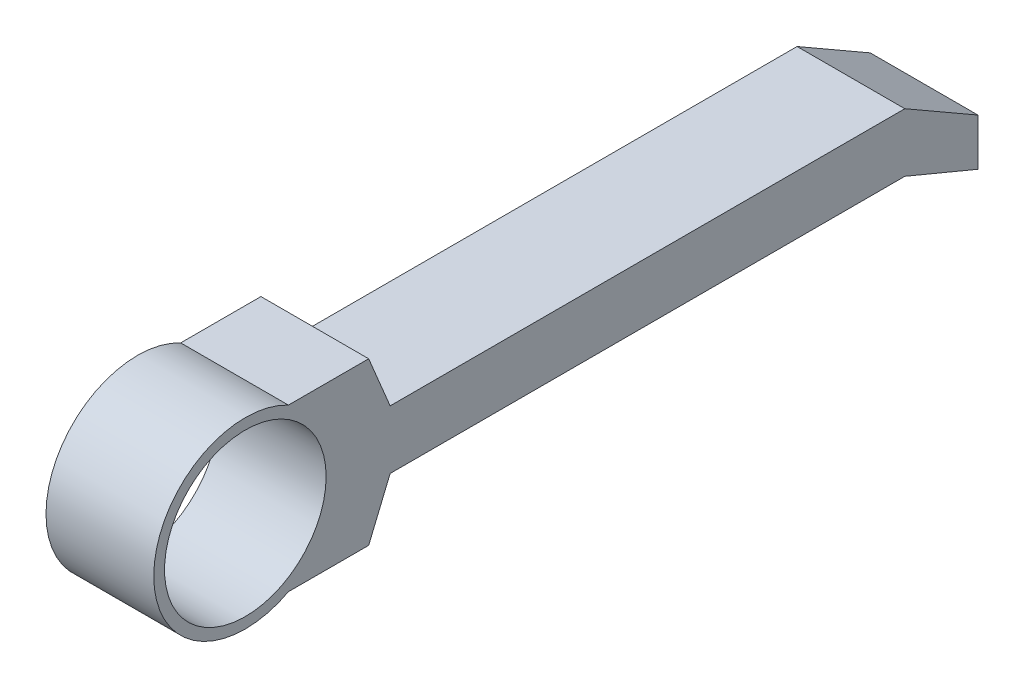
ISO-10303-21;
HEADER;
FILE_DESCRIPTION(('STEP AP214'),'2;1');
FILE_NAME('part.step','',(''),(''),'','','');
FILE_SCHEMA(('AUTOMOTIVE_DESIGN { 1 0 10303 214 1 1 1 1 }'));
ENDSEC;
DATA;
#1=APPLICATION_CONTEXT('core data for automotive mechanical design processes');
#2=APPLICATION_PROTOCOL_DEFINITION('international standard','automotive_design',2000,#1);
#3=PRODUCT_CONTEXT('',#1,'mechanical');
#4=PRODUCT('Part','Part','',(#3));
#5=PRODUCT_RELATED_PRODUCT_CATEGORY('part','',(#4));
#6=PRODUCT_DEFINITION_FORMATION('','',#4);
#7=PRODUCT_DEFINITION_CONTEXT('part definition',#1,'design');
#8=PRODUCT_DEFINITION('design','',#6,#7);
#9=PRODUCT_DEFINITION_SHAPE('','',#8);
#10=(LENGTH_UNIT() NAMED_UNIT(*) SI_UNIT(.MILLI.,.METRE.));
#11=(NAMED_UNIT(*) PLANE_ANGLE_UNIT() SI_UNIT($,.RADIAN.));
#12=(NAMED_UNIT(*) SI_UNIT($,.STERADIAN.) SOLID_ANGLE_UNIT());
#13=UNCERTAINTY_MEASURE_WITH_UNIT(LENGTH_MEASURE(1.E-05),#10,'distance_accuracy_value','');
#14=(GEOMETRIC_REPRESENTATION_CONTEXT(3) GLOBAL_UNCERTAINTY_ASSIGNED_CONTEXT((#13)) GLOBAL_UNIT_ASSIGNED_CONTEXT((#10,
#11,#12)) REPRESENTATION_CONTEXT('',''));
#15=CARTESIAN_POINT('',(0.,0.,0.));
#16=DIRECTION('',(0.,0.,1.));
#17=DIRECTION('',(1.,0.,0.));
#18=AXIS2_PLACEMENT_3D('',#15,#16,#17);
#19=CARTESIAN_POINT('',(2.,1.5,0.));
#20=DIRECTION('',(0.,1.,0.));
#21=DIRECTION('',(0.,0.,1.));
#22=AXIS2_PLACEMENT_3D('',#19,#20,#21);
#23=PLANE('',#22);
#24=DIRECTION('',(0.,0.,-1.));
#25=VECTOR('',#24,1.);
#26=CARTESIAN_POINT('',(0.,1.5,0.));
#27=LINE('',#26,#25);
#28=CARTESIAN_POINT('',(0.,1.5,-0.8));
#29=VERTEX_POINT('',#28);
#30=CARTESIAN_POINT('',(0.,1.5,-2.28958518857498));
#31=VERTEX_POINT('',#30);
#32=EDGE_CURVE('E143',#29,#31,#27,.T.);
#33=ORIENTED_EDGE('',*,*,#32,.F.);
#34=DIRECTION('',(-1.,0.,0.));
#35=VECTOR('',#34,1.);
#36=CARTESIAN_POINT('',(2.,1.5,-0.8));
#37=LINE('',#36,#35);
#38=CARTESIAN_POINT('',(2.,1.5,-0.8));
#39=VERTEX_POINT('',#38);
#40=EDGE_CURVE('E11',#39,#29,#37,.T.);
#41=ORIENTED_EDGE('',*,*,#40,.F.);
#42=DIRECTION('',(0.,0.,-1.));
#43=VECTOR('',#42,1.);
#44=CARTESIAN_POINT('',(2.,1.5,0.));
#45=LINE('',#44,#43);
#46=CARTESIAN_POINT('',(2.,1.5,-2.28958518857498));
#47=VERTEX_POINT('',#46);
#48=EDGE_CURVE('E168',#39,#47,#45,.T.);
#49=ORIENTED_EDGE('',*,*,#48,.T.);
#50=DIRECTION('',(-1.,0.,0.));
#51=VECTOR('',#50,1.);
#52=CARTESIAN_POINT('',(2.,1.5,-2.28958518857498));
#53=LINE('',#52,#51);
#54=EDGE_CURVE('E50',#47,#31,#53,.T.);
#55=ORIENTED_EDGE('',*,*,#54,.T.);
#56=EDGE_LOOP('',(#33,#41,#49,#55));
#57=FACE_BOUND('',#56,.T.);
#58=ADVANCED_FACE('F34',(#57),#23,.T.);
#59=CARTESIAN_POINT('',(2.,0.,0.));
#60=DIRECTION('',(-1.,0.,0.));
#61=DIRECTION('',(0.,0.,1.));
#62=AXIS2_PLACEMENT_3D('',#59,#60,#61);
#63=CYLINDRICAL_SURFACE('',#62,1.7);
#64=CARTESIAN_POINT('',(0.,0.,0.));
#65=DIRECTION('',(1.,0.,0.));
#66=DIRECTION('',(0.,0.,-1.));
#67=AXIS2_PLACEMENT_3D('',#64,#65,#66);
#68=CIRCLE('',#67,1.7);
#69=CARTESIAN_POINT('',(0.,-1.5,-0.8));
#70=VERTEX_POINT('',#69);
#71=EDGE_CURVE('E145',#29,#70,#68,.T.);
#72=ORIENTED_EDGE('',*,*,#71,.T.);
#73=DIRECTION('',(-1.,0.,0.));
#74=VECTOR('',#73,1.);
#75=CARTESIAN_POINT('',(2.,-1.5,-0.8));
#76=LINE('',#75,#74);
#77=CARTESIAN_POINT('',(2.,-1.5,-0.8));
#78=VERTEX_POINT('',#77);
#79=EDGE_CURVE('E42',#78,#70,#76,.T.);
#80=ORIENTED_EDGE('',*,*,#79,.F.);
#81=CARTESIAN_POINT('',(2.,0.,0.));
#82=DIRECTION('',(1.,0.,0.));
#83=DIRECTION('',(0.,0.,-1.));
#84=AXIS2_PLACEMENT_3D('',#81,#82,#83);
#85=CIRCLE('',#84,1.7);
#86=EDGE_CURVE('E344',#39,#78,#85,.T.);
#87=ORIENTED_EDGE('',*,*,#86,.F.);
#88=ORIENTED_EDGE('',*,*,#40,.T.);
#89=EDGE_LOOP('',(#72,#80,#87,#88));
#90=FACE_BOUND('',#89,.T.);
#91=ADVANCED_FACE('F230',(#90),#63,.T.);
#92=CARTESIAN_POINT('',(2.,-1.5,0.));
#93=DIRECTION('',(0.,1.,0.));
#94=DIRECTION('',(0.,0.,1.));
#95=AXIS2_PLACEMENT_3D('',#92,#93,#94);
#96=PLANE('',#95);
#97=DIRECTION('',(0.,0.,-1.));
#98=VECTOR('',#97,1.);
#99=CARTESIAN_POINT('',(0.,-1.5,0.));
#100=LINE('',#99,#98);
#101=CARTESIAN_POINT('',(0.,-1.5,-2.28958518857498));
#102=VERTEX_POINT('',#101);
#103=EDGE_CURVE('E147',#70,#102,#100,.T.);
#104=ORIENTED_EDGE('',*,*,#103,.T.);
#105=DIRECTION('',(-1.,0.,0.));
#106=VECTOR('',#105,1.);
#107=CARTESIAN_POINT('',(2.,-1.5,-2.28958518857498));
#108=LINE('',#107,#106);
#109=CARTESIAN_POINT('',(2.,-1.5,-2.28958518857498));
#110=VERTEX_POINT('',#109);
#111=EDGE_CURVE('E180',#110,#102,#108,.T.);
#112=ORIENTED_EDGE('',*,*,#111,.F.);
#113=DIRECTION('',(0.,0.,-1.));
#114=VECTOR('',#113,1.);
#115=CARTESIAN_POINT('',(2.,-1.5,0.));
#116=LINE('',#115,#114);
#117=EDGE_CURVE('E189',#78,#110,#116,.T.);
#118=ORIENTED_EDGE('',*,*,#117,.F.);
#119=ORIENTED_EDGE('',*,*,#79,.T.);
#120=EDGE_LOOP('',(#104,#112,#118,#119));
#121=FACE_BOUND('',#120,.T.);
#122=ADVANCED_FACE('F187',(#121),#96,.F.);
#123=CARTESIAN_POINT('',(2.,-1.0345374363103,-2.48348170355575));
#124=DIRECTION('',(0.,0.384537279263045,0.923109463095778));
#125=DIRECTION('',(0.,-0.923109463095778,0.384537279263045));
#126=AXIS2_PLACEMENT_3D('',#123,#124,#125);
#127=PLANE('',#126);
#128=DIRECTION('',(0.,0.923109463095778,-0.384537279263045));
#129=VECTOR('',#128,1.);
#130=CARTESIAN_POINT('',(0.,-1.0345374363103,-2.48348170355575));
#131=LINE('',#130,#129);
#132=CARTESIAN_POINT('',(0.,-0.543556392264373,-2.68800838472959));
#133=VERTEX_POINT('',#132);
#134=EDGE_CURVE('E149',#102,#133,#131,.T.);
#135=ORIENTED_EDGE('',*,*,#134,.T.);
#136=DIRECTION('',(-1.,0.,0.));
#137=VECTOR('',#136,1.);
#138=CARTESIAN_POINT('',(2.,-0.543556392264373,-2.68800838472959));
#139=LINE('',#138,#137);
#140=CARTESIAN_POINT('',(2.,-0.543556392264373,-2.68800838472959));
#141=VERTEX_POINT('',#140);
#142=EDGE_CURVE('E177',#141,#133,#139,.T.);
#143=ORIENTED_EDGE('',*,*,#142,.F.);
#144=DIRECTION('',(0.,0.923109463095778,-0.384537279263045));
#145=VECTOR('',#144,1.);
#146=CARTESIAN_POINT('',(2.,-1.0345374363103,-2.48348170355575));
#147=LINE('',#146,#145);
#148=EDGE_CURVE('E209',#110,#141,#147,.T.);
#149=ORIENTED_EDGE('',*,*,#148,.F.);
#150=ORIENTED_EDGE('',*,*,#111,.T.);
#151=EDGE_LOOP('',(#135,#143,#149,#150));
#152=FACE_BOUND('',#151,.T.);
#153=ADVANCED_FACE('F200',(#152),#127,.F.);
#154=CARTESIAN_POINT('',(2.,-0.543556392264373,0.));
#155=DIRECTION('',(0.,1.,0.));
#156=DIRECTION('',(0.,0.,1.));
#157=AXIS2_PLACEMENT_3D('',#154,#155,#156);
#158=PLANE('',#157);
#159=DIRECTION('',(0.,0.,-1.));
#160=VECTOR('',#159,1.);
#161=CARTESIAN_POINT('',(0.,-0.543556392264373,0.));
#162=LINE('',#161,#160);
#163=CARTESIAN_POINT('',(0.,-0.543556392264373,-12.2417096191978));
#164=VERTEX_POINT('',#163);
#165=EDGE_CURVE('E151',#133,#164,#162,.T.);
#166=ORIENTED_EDGE('',*,*,#165,.T.);
#167=DIRECTION('',(-1.,0.,0.));
#168=VECTOR('',#167,1.);
#169=CARTESIAN_POINT('',(2.,-0.543556392264373,-12.2417096191978));
#170=LINE('',#169,#168);
#171=CARTESIAN_POINT('',(2.,-0.543556392264373,-12.2417096191978));
#172=VERTEX_POINT('',#171);
#173=EDGE_CURVE('E174',#172,#164,#170,.T.);
#174=ORIENTED_EDGE('',*,*,#173,.F.);
#175=DIRECTION('',(0.,0.,-1.));
#176=VECTOR('',#175,1.);
#177=CARTESIAN_POINT('',(2.,-0.543556392264373,0.));
#178=LINE('',#177,#176);
#179=EDGE_CURVE('E206',#141,#172,#178,.T.);
#180=ORIENTED_EDGE('',*,*,#179,.F.);
#181=ORIENTED_EDGE('',*,*,#142,.T.);
#182=EDGE_LOOP('',(#166,#174,#180,#181));
#183=FACE_BOUND('',#182,.T.);
#184=ADVANCED_FACE('F204',(#183),#158,.F.);
#185=CARTESIAN_POINT('',(2.,3.88225838462814,-1.61722215653005));
#186=DIRECTION('',(0.,0.923109463095778,-0.384537279263045));
#187=DIRECTION('',(0.,0.384537279263045,0.923109463095778));
#188=AXIS2_PLACEMENT_3D('',#185,#186,#187);
#189=PLANE('',#188);
#190=DIRECTION('',(0.,-0.384537279263045,-0.923109463095778));
#191=VECTOR('',#190,1.);
#192=CARTESIAN_POINT('',(0.,3.88225838462814,-1.61722215653005));
#193=LINE('',#192,#191);
#194=CARTESIAN_POINT('',(0.,-1.10937584094728,-13.6));
#195=VERTEX_POINT('',#194);
#196=EDGE_CURVE('E153',#164,#195,#193,.T.);
#197=ORIENTED_EDGE('',*,*,#196,.T.);
#198=DIRECTION('',(-1.,0.,0.));
#199=VECTOR('',#198,1.);
#200=CARTESIAN_POINT('',(2.,-1.10937584094728,-13.6));
#201=LINE('',#200,#199);
#202=CARTESIAN_POINT('',(2.,-1.10937584094728,-13.6));
#203=VERTEX_POINT('',#202);
#204=EDGE_CURVE('E172',#203,#195,#201,.T.);
#205=ORIENTED_EDGE('',*,*,#204,.F.);
#206=DIRECTION('',(0.,-0.384537279263045,-0.923109463095778));
#207=VECTOR('',#206,1.);
#208=CARTESIAN_POINT('',(2.,3.88225838462814,-1.61722215653005));
#209=LINE('',#208,#207);
#210=EDGE_CURVE('E208',#172,#203,#209,.T.);
#211=ORIENTED_EDGE('',*,*,#210,.F.);
#212=ORIENTED_EDGE('',*,*,#173,.T.);
#213=EDGE_LOOP('',(#197,#205,#211,#212));
#214=FACE_BOUND('',#213,.T.);
#215=ADVANCED_FACE('F243',(#214),#189,.F.);
#216=CARTESIAN_POINT('',(2.,0.,-13.6));
#217=DIRECTION('',(0.,0.,-1.));
#218=DIRECTION('',(-1.,0.,0.));
#219=AXIS2_PLACEMENT_3D('',#216,#217,#218);
#220=PLANE('',#219);
#221=DIRECTION('',(0.,-1.,0.));
#222=VECTOR('',#221,1.);
#223=CARTESIAN_POINT('',(0.,0.,-13.6));
#224=LINE('',#223,#222);
#225=CARTESIAN_POINT('',(0.,-0.237921661948802,-13.6));
#226=VERTEX_POINT('',#225);
#227=EDGE_CURVE('E156',#226,#195,#224,.T.);
#228=ORIENTED_EDGE('',*,*,#227,.F.);
#229=DIRECTION('',(-1.,0.,0.));
#230=VECTOR('',#229,1.);
#231=CARTESIAN_POINT('',(2.,-0.237921661948802,-13.6));
#232=LINE('',#231,#230);
#233=CARTESIAN_POINT('',(2.,-0.237921661948802,-13.6));
#234=VERTEX_POINT('',#233);
#235=EDGE_CURVE('E121',#234,#226,#232,.T.);
#236=ORIENTED_EDGE('',*,*,#235,.F.);
#237=DIRECTION('',(0.,-1.,0.));
#238=VECTOR('',#237,1.);
#239=CARTESIAN_POINT('',(2.,0.,-13.6));
#240=LINE('',#239,#238);
#241=EDGE_CURVE('E132',#234,#203,#240,.T.);
#242=ORIENTED_EDGE('',*,*,#241,.T.);
#243=ORIENTED_EDGE('',*,*,#204,.T.);
#244=EDGE_LOOP('',(#228,#236,#242,#243));
#245=FACE_BOUND('',#244,.T.);
#246=ADVANCED_FACE('F216',(#245),#220,.T.);
#247=CARTESIAN_POINT('',(2.,5.69992988580402,-3.27939458253327));
#248=DIRECTION('',(0.,0.866779126948206,-0.498692234837185));
#249=DIRECTION('',(0.,0.498692234837185,0.866779126948206));
#250=AXIS2_PLACEMENT_3D('',#247,#248,#249);
#251=PLANE('',#250);
#252=DIRECTION('',(0.,-0.498692234837185,-0.866779126948206));
#253=VECTOR('',#252,1.);
#254=CARTESIAN_POINT('',(0.,5.69992988580402,-3.27939458253327));
#255=LINE('',#254,#253);
#256=CARTESIAN_POINT('',(0.,0.543556392264373,-12.2417096191978));
#257=VERTEX_POINT('',#256);
#258=EDGE_CURVE('E117',#257,#226,#255,.T.);
#259=ORIENTED_EDGE('',*,*,#258,.F.);
#260=DIRECTION('',(-1.,0.,0.));
#261=VECTOR('',#260,1.);
#262=CARTESIAN_POINT('',(2.,0.543556392264373,-12.2417096191978));
#263=LINE('',#262,#261);
#264=CARTESIAN_POINT('',(2.,0.543556392264373,-12.2417096191978));
#265=VERTEX_POINT('',#264);
#266=EDGE_CURVE('E112',#265,#257,#263,.T.);
#267=ORIENTED_EDGE('',*,*,#266,.F.);
#268=DIRECTION('',(0.,-0.498692234837185,-0.866779126948206));
#269=VECTOR('',#268,1.);
#270=CARTESIAN_POINT('',(2.,5.69992988580402,-3.27939458253327));
#271=LINE('',#270,#269);
#272=EDGE_CURVE('E115',#265,#234,#271,.T.);
#273=ORIENTED_EDGE('',*,*,#272,.T.);
#274=ORIENTED_EDGE('',*,*,#235,.T.);
#275=EDGE_LOOP('',(#259,#267,#273,#274));
#276=FACE_BOUND('',#275,.T.);
#277=ADVANCED_FACE('F114',(#276),#251,.T.);
#278=CARTESIAN_POINT('',(2.,0.543556392264373,0.));
#279=DIRECTION('',(0.,1.,0.));
#280=DIRECTION('',(0.,0.,1.));
#281=AXIS2_PLACEMENT_3D('',#278,#279,#280);
#282=PLANE('',#281);
#283=DIRECTION('',(0.,0.,-1.));
#284=VECTOR('',#283,1.);
#285=CARTESIAN_POINT('',(0.,0.543556392264373,0.));
#286=LINE('',#285,#284);
#287=CARTESIAN_POINT('',(0.,0.543556392264373,-2.68800838472959));
#288=VERTEX_POINT('',#287);
#289=EDGE_CURVE('E160',#288,#257,#286,.T.);
#290=ORIENTED_EDGE('',*,*,#289,.F.);
#291=DIRECTION('',(-1.,0.,0.));
#292=VECTOR('',#291,1.);
#293=CARTESIAN_POINT('',(2.,0.543556392264373,-2.68800838472959));
#294=LINE('',#293,#292);
#295=CARTESIAN_POINT('',(2.,0.543556392264373,-2.68800838472959));
#296=VERTEX_POINT('',#295);
#297=EDGE_CURVE('E81',#296,#288,#294,.T.);
#298=ORIENTED_EDGE('',*,*,#297,.F.);
#299=DIRECTION('',(0.,0.,-1.));
#300=VECTOR('',#299,1.);
#301=CARTESIAN_POINT('',(2.,0.543556392264373,0.));
#302=LINE('',#301,#300);
#303=EDGE_CURVE('E130',#296,#265,#302,.T.);
#304=ORIENTED_EDGE('',*,*,#303,.T.);
#305=ORIENTED_EDGE('',*,*,#266,.T.);
#306=EDGE_LOOP('',(#290,#298,#304,#305));
#307=FACE_BOUND('',#306,.T.);
#308=ADVANCED_FACE('F134',(#307),#282,.T.);
#309=CARTESIAN_POINT('',(2.,1.0345374363103,-2.48348170355575));
#310=DIRECTION('',(0.,0.384537279263045,-0.923109463095778));
#311=DIRECTION('',(0.,0.923109463095778,0.384537279263045));
#312=AXIS2_PLACEMENT_3D('',#309,#310,#311);
#313=PLANE('',#312);
#314=DIRECTION('',(0.,-0.923109463095778,-0.384537279263045));
#315=VECTOR('',#314,1.);
#316=CARTESIAN_POINT('',(0.,1.0345374363103,-2.48348170355575));
#317=LINE('',#316,#315);
#318=EDGE_CURVE('E162',#31,#288,#317,.T.);
#319=ORIENTED_EDGE('',*,*,#318,.F.);
#320=ORIENTED_EDGE('',*,*,#54,.F.);
#321=DIRECTION('',(0.,-0.923109463095778,-0.384537279263045));
#322=VECTOR('',#321,1.);
#323=CARTESIAN_POINT('',(2.,1.0345374363103,-2.48348170355575));
#324=LINE('',#323,#322);
#325=EDGE_CURVE('E135',#47,#296,#324,.T.);
#326=ORIENTED_EDGE('',*,*,#325,.T.);
#327=ORIENTED_EDGE('',*,*,#297,.T.);
#328=EDGE_LOOP('',(#319,#320,#326,#327));
#329=FACE_BOUND('',#328,.T.);
#330=ADVANCED_FACE('F218',(#329),#313,.T.);
#331=CARTESIAN_POINT('',(2.,0.,0.));
#332=DIRECTION('',(-1.,0.,0.));
#333=DIRECTION('',(0.,0.,1.));
#334=AXIS2_PLACEMENT_3D('',#331,#332,#333);
#335=CYLINDRICAL_SURFACE('',#334,1.5);
#336=CARTESIAN_POINT('',(2.,0.,0.));
#337=DIRECTION('',(1.,0.,0.));
#338=DIRECTION('',(0.,0.,-1.));
#339=AXIS2_PLACEMENT_3D('',#336,#337,#338);
#340=CIRCLE('',#339,1.5);
#341=CARTESIAN_POINT('',(2.,0.,-1.5));
#342=VERTEX_POINT('',#341);
#343=EDGE_CURVE('E137',#342,#342,#340,.T.);
#344=ORIENTED_EDGE('',*,*,#343,.T.);
#345=EDGE_LOOP('',(#344));
#346=FACE_BOUND('',#345,.T.);
#347=CARTESIAN_POINT('',(0.,0.,0.));
#348=DIRECTION('',(1.,0.,0.));
#349=DIRECTION('',(0.,0.,-1.));
#350=AXIS2_PLACEMENT_3D('',#347,#348,#349);
#351=CIRCLE('',#350,1.5);
#352=CARTESIAN_POINT('',(0.,0.,-1.5));
#353=VERTEX_POINT('',#352);
#354=EDGE_CURVE('E165',#353,#353,#351,.T.);
#355=ORIENTED_EDGE('',*,*,#354,.F.);
#356=EDGE_LOOP('',(#355));
#357=FACE_BOUND('',#356,.T.);
#358=ADVANCED_FACE('F220',(#346,#357),#335,.F.);
#359=CARTESIAN_POINT('',(2.,0.,0.));
#360=DIRECTION('',(1.,0.,0.));
#361=DIRECTION('',(0.,0.,-1.));
#362=AXIS2_PLACEMENT_3D('',#359,#360,#361);
#363=PLANE('',#362);
#364=ORIENTED_EDGE('',*,*,#48,.F.);
#365=ORIENTED_EDGE('',*,*,#86,.T.);
#366=ORIENTED_EDGE('',*,*,#117,.T.);
#367=ORIENTED_EDGE('',*,*,#148,.T.);
#368=ORIENTED_EDGE('',*,*,#179,.T.);
#369=ORIENTED_EDGE('',*,*,#210,.T.);
#370=ORIENTED_EDGE('',*,*,#241,.F.);
#371=ORIENTED_EDGE('',*,*,#272,.F.);
#372=ORIENTED_EDGE('',*,*,#303,.F.);
#373=ORIENTED_EDGE('',*,*,#325,.F.);
#374=EDGE_LOOP('',(#364,#365,#366,#367,#368,#369,#370,#371,#372,#373));
#375=FACE_BOUND('',#374,.T.);
#376=ORIENTED_EDGE('',*,*,#343,.F.);
#377=EDGE_LOOP('',(#376));
#378=FACE_BOUND('',#377,.T.);
#379=ADVANCED_FACE('F127',(#375,#378),#363,.T.);
#380=CARTESIAN_POINT('',(0.,0.,0.));
#381=DIRECTION('',(1.,0.,0.));
#382=DIRECTION('',(0.,0.,-1.));
#383=AXIS2_PLACEMENT_3D('',#380,#381,#382);
#384=PLANE('',#383);
#385=ORIENTED_EDGE('',*,*,#32,.T.);
#386=ORIENTED_EDGE('',*,*,#318,.T.);
#387=ORIENTED_EDGE('',*,*,#289,.T.);
#388=ORIENTED_EDGE('',*,*,#258,.T.);
#389=ORIENTED_EDGE('',*,*,#227,.T.);
#390=ORIENTED_EDGE('',*,*,#196,.F.);
#391=ORIENTED_EDGE('',*,*,#165,.F.);
#392=ORIENTED_EDGE('',*,*,#134,.F.);
#393=ORIENTED_EDGE('',*,*,#103,.F.);
#394=ORIENTED_EDGE('',*,*,#71,.F.);
#395=EDGE_LOOP('',(#385,#386,#387,#388,#389,#390,#391,#392,#393,#394));
#396=FACE_BOUND('',#395,.T.);
#397=ORIENTED_EDGE('',*,*,#354,.T.);
#398=EDGE_LOOP('',(#397));
#399=FACE_BOUND('',#398,.T.);
#400=ADVANCED_FACE('F194',(#396,#399),#384,.F.);
#401=CLOSED_SHELL('',(#58,#91,#122,#153,#184,#215,#246,#277,#308,#330,#358,#379,#400));
#402=MANIFOLD_SOLID_BREP('B2',#401);
#403=ADVANCED_BREP_SHAPE_REPRESENTATION('',(#18,#402),#14);
#404=SHAPE_DEFINITION_REPRESENTATION(#9,#403);
ENDSEC;
END-ISO-10303-21;
